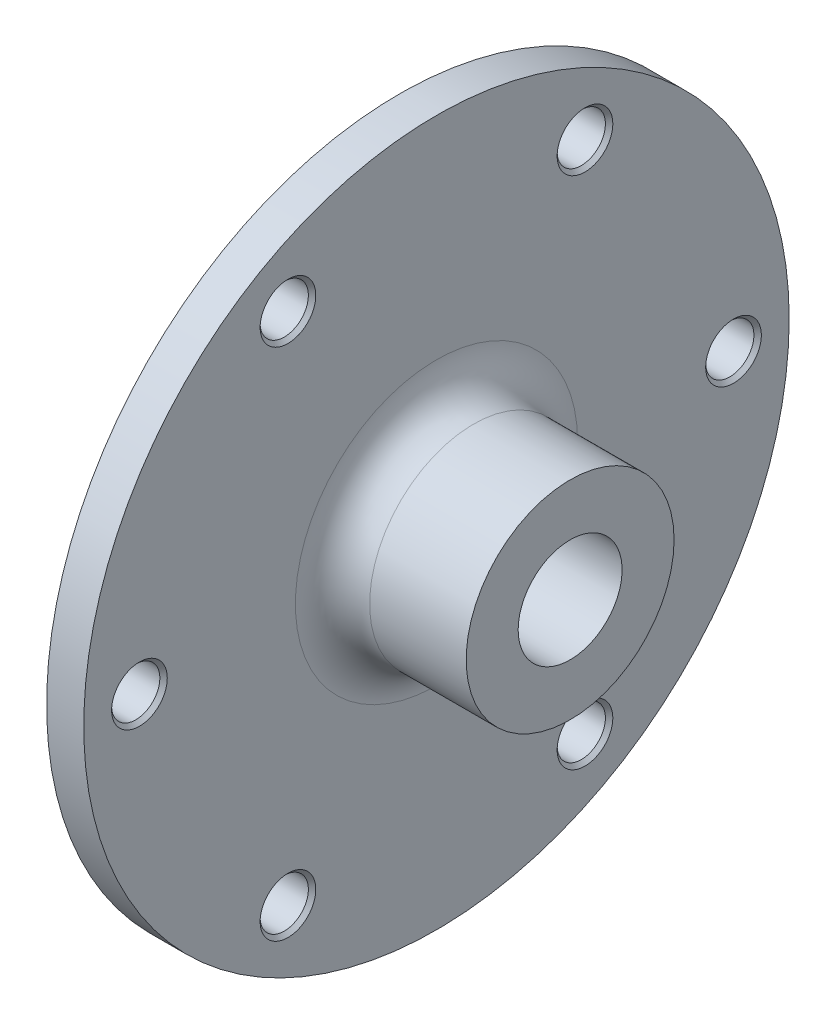
ISO-10303-21;
HEADER;
FILE_DESCRIPTION(('STEP AP214'),'2;1');
FILE_NAME('part.step','',(''),(''),'','','');
FILE_SCHEMA(('AUTOMOTIVE_DESIGN { 1 0 10303 214 1 1 1 1 }'));
ENDSEC;
DATA;
#1=APPLICATION_CONTEXT('core data for automotive mechanical design processes');
#2=APPLICATION_PROTOCOL_DEFINITION('international standard','automotive_design',2000,#1);
#3=PRODUCT_CONTEXT('',#1,'mechanical');
#4=PRODUCT('Part','Part','',(#3));
#5=PRODUCT_RELATED_PRODUCT_CATEGORY('part','',(#4));
#6=PRODUCT_DEFINITION_FORMATION('','',#4);
#7=PRODUCT_DEFINITION_CONTEXT('part definition',#1,'design');
#8=PRODUCT_DEFINITION('design','',#6,#7);
#9=PRODUCT_DEFINITION_SHAPE('','',#8);
#10=(LENGTH_UNIT() NAMED_UNIT(*) SI_UNIT(.MILLI.,.METRE.));
#11=(NAMED_UNIT(*) PLANE_ANGLE_UNIT() SI_UNIT($,.RADIAN.));
#12=(NAMED_UNIT(*) SI_UNIT($,.STERADIAN.) SOLID_ANGLE_UNIT());
#13=UNCERTAINTY_MEASURE_WITH_UNIT(LENGTH_MEASURE(1.E-05),#10,'distance_accuracy_value','');
#14=(GEOMETRIC_REPRESENTATION_CONTEXT(3) GLOBAL_UNCERTAINTY_ASSIGNED_CONTEXT((#13)) GLOBAL_UNIT_ASSIGNED_CONTEXT((#10,
#11,#12)) REPRESENTATION_CONTEXT('',''));
#15=CARTESIAN_POINT('',(0.,0.,0.));
#16=DIRECTION('',(0.,0.,1.));
#17=DIRECTION('',(1.,0.,0.));
#18=AXIS2_PLACEMENT_3D('',#15,#16,#17);
#19=CARTESIAN_POINT('',(0.,14.,0.));
#20=DIRECTION('',(1.,0.,0.));
#21=DIRECTION('',(0.,0.,-1.));
#22=AXIS2_PLACEMENT_3D('',#19,#20,#21);
#23=PLANE('',#22);
#24=CARTESIAN_POINT('',(0.,0.,0.));
#25=DIRECTION('',(-1.,0.,0.));
#26=DIRECTION('',(0.,0.,1.));
#27=AXIS2_PLACEMENT_3D('',#24,#25,#26);
#28=CIRCLE('',#27,6.99999999999999);
#29=CARTESIAN_POINT('',(0.,0.,6.99999999999999));
#30=VERTEX_POINT('',#29);
#31=EDGE_CURVE('E77',#30,#30,#28,.T.);
#32=ORIENTED_EDGE('',*,*,#31,.T.);
#33=EDGE_LOOP('',(#32));
#34=FACE_BOUND('',#33,.T.);
#35=CARTESIAN_POINT('',(0.,0.,0.));
#36=DIRECTION('',(1.,0.,0.));
#37=DIRECTION('',(0.,0.,-1.));
#38=AXIS2_PLACEMENT_3D('',#35,#36,#37);
#39=CIRCLE('',#38,14.);
#40=CARTESIAN_POINT('',(0.,0.,-14.));
#41=VERTEX_POINT('',#40);
#42=EDGE_CURVE('E73',#41,#41,#39,.T.);
#43=ORIENTED_EDGE('',*,*,#42,.T.);
#44=EDGE_LOOP('',(#43));
#45=FACE_BOUND('',#44,.T.);
#46=ADVANCED_FACE('F41',(#34,#45),#23,.T.);
#47=CARTESIAN_POINT('',(-28.,0.,0.));
#48=DIRECTION('',(-1.,0.,0.));
#49=DIRECTION('',(0.,0.,1.));
#50=AXIS2_PLACEMENT_3D('',#47,#48,#49);
#51=PLANE('',#50);
#52=CARTESIAN_POINT('',(-28.,0.,0.));
#53=DIRECTION('',(-1.,0.,0.));
#54=DIRECTION('',(0.,0.,1.));
#55=AXIS2_PLACEMENT_3D('',#52,#53,#54);
#56=CIRCLE('',#55,13.);
#57=CARTESIAN_POINT('',(-28.,0.,13.));
#58=VERTEX_POINT('',#57);
#59=EDGE_CURVE('E85',#58,#58,#56,.T.);
#60=ORIENTED_EDGE('',*,*,#59,.F.);
#61=EDGE_LOOP('',(#60));
#62=FACE_BOUND('',#61,.T.);
#63=CARTESIAN_POINT('',(-28.,0.,0.));
#64=DIRECTION('',(1.,0.,0.));
#65=DIRECTION('',(0.,0.,-1.));
#66=AXIS2_PLACEMENT_3D('',#63,#64,#65);
#67=CIRCLE('',#66,35.);
#68=CARTESIAN_POINT('',(-28.,0.,-35.));
#69=VERTEX_POINT('',#68);
#70=EDGE_CURVE('E55',#69,#69,#67,.T.);
#71=ORIENTED_EDGE('',*,*,#70,.F.);
#72=EDGE_LOOP('',(#71));
#73=FACE_BOUND('',#72,.T.);
#74=ADVANCED_FACE('F184',(#62,#73),#51,.T.);
#75=CARTESIAN_POINT('',(0.,0.,0.));
#76=DIRECTION('',(1.,0.,0.));
#77=DIRECTION('',(0.,0.,-1.));
#78=AXIS2_PLACEMENT_3D('',#75,#76,#77);
#79=CYLINDRICAL_SURFACE('',#78,35.);
#80=ORIENTED_EDGE('',*,*,#70,.T.);
#81=EDGE_LOOP('',(#80));
#82=FACE_BOUND('',#81,.T.);
#83=CARTESIAN_POINT('',(-23.,0.,0.));
#84=DIRECTION('',(1.,0.,0.));
#85=DIRECTION('',(0.,0.,-1.));
#86=AXIS2_PLACEMENT_3D('',#83,#84,#85);
#87=CIRCLE('',#86,35.);
#88=CARTESIAN_POINT('',(-23.,0.,-35.));
#89=VERTEX_POINT('',#88);
#90=EDGE_CURVE('E61',#89,#89,#87,.T.);
#91=ORIENTED_EDGE('',*,*,#90,.F.);
#92=EDGE_LOOP('',(#91));
#93=FACE_BOUND('',#92,.T.);
#94=ADVANCED_FACE('F180',(#82,#93),#79,.T.);
#95=CARTESIAN_POINT('',(-23.,35.,0.));
#96=DIRECTION('',(-1.,0.,0.));
#97=DIRECTION('',(0.,0.,1.));
#98=AXIS2_PLACEMENT_3D('',#95,#96,#97);
#99=PLANE('',#98);
#100=CARTESIAN_POINT('',(-23.,34.6410161513773,20.0000000000004));
#101=DIRECTION('',(-1.,0.,0.));
#102=DIRECTION('',(0.,0.866025403784433,0.50000000000001));
#103=AXIS2_PLACEMENT_3D('',#100,#101,#102);
#104=CIRCLE('',#103,3.25);
#105=CARTESIAN_POINT('',(-23.,37.4555987136767,21.6250000000004));
#106=VERTEX_POINT('',#105);
#107=EDGE_CURVE('E115',#106,#106,#104,.T.);
#108=ORIENTED_EDGE('',*,*,#107,.F.);
#109=EDGE_LOOP('',(#108));
#110=FACE_BOUND('',#109,.T.);
#111=CARTESIAN_POINT('',(-23.,34.6410161513777,-19.9999999999997));
#112=DIRECTION('',(-1.,0.,0.));
#113=DIRECTION('',(0.,0.866025403784443,-0.499999999999992));
#114=AXIS2_PLACEMENT_3D('',#111,#112,#113);
#115=CIRCLE('',#114,3.25);
#116=CARTESIAN_POINT('',(-23.,37.4555987136772,-21.6249999999997));
#117=VERTEX_POINT('',#116);
#118=EDGE_CURVE('E128',#117,#117,#115,.T.);
#119=ORIENTED_EDGE('',*,*,#118,.F.);
#120=EDGE_LOOP('',(#119));
#121=FACE_BOUND('',#120,.T.);
#122=CARTESIAN_POINT('',(-23.,0.,-40.));
#123=DIRECTION('',(-1.,0.,0.));
#124=DIRECTION('',(0.,0.,-1.));
#125=AXIS2_PLACEMENT_3D('',#122,#123,#124);
#126=CIRCLE('',#125,3.25);
#127=CARTESIAN_POINT('',(-23.,0.,-43.25));
#128=VERTEX_POINT('',#127);
#129=EDGE_CURVE('E140',#128,#128,#126,.T.);
#130=ORIENTED_EDGE('',*,*,#129,.F.);
#131=EDGE_LOOP('',(#130));
#132=FACE_BOUND('',#131,.T.);
#133=CARTESIAN_POINT('',(-23.,-34.6410161513775,-20.0000000000002));
#134=DIRECTION('',(-1.,0.,0.));
#135=DIRECTION('',(0.,-0.866025403784436,-0.500000000000004));
#136=AXIS2_PLACEMENT_3D('',#133,#134,#135);
#137=CIRCLE('',#136,3.25);
#138=CARTESIAN_POINT('',(-23.,-37.4555987136769,-21.6250000000002));
#139=VERTEX_POINT('',#138);
#140=EDGE_CURVE('E150',#139,#139,#137,.T.);
#141=ORIENTED_EDGE('',*,*,#140,.F.);
#142=EDGE_LOOP('',(#141));
#143=FACE_BOUND('',#142,.T.);
#144=CARTESIAN_POINT('',(-23.,-34.6410161513776,19.9999999999999));
#145=DIRECTION('',(-1.,0.,0.));
#146=DIRECTION('',(0.,-0.86602540378444,0.499999999999998));
#147=AXIS2_PLACEMENT_3D('',#144,#145,#146);
#148=CIRCLE('',#147,3.25);
#149=CARTESIAN_POINT('',(-23.,-37.455598713677,21.6249999999999));
#150=VERTEX_POINT('',#149);
#151=EDGE_CURVE('E101',#150,#150,#148,.T.);
#152=ORIENTED_EDGE('',*,*,#151,.F.);
#153=EDGE_LOOP('',(#152));
#154=FACE_BOUND('',#153,.T.);
#155=CARTESIAN_POINT('',(-23.,0.,40.));
#156=DIRECTION('',(-1.,0.,0.));
#157=DIRECTION('',(0.,0.,1.));
#158=AXIS2_PLACEMENT_3D('',#155,#156,#157);
#159=CIRCLE('',#158,3.25);
#160=CARTESIAN_POINT('',(-23.,0.,43.25));
#161=VERTEX_POINT('',#160);
#162=EDGE_CURVE('E45',#161,#161,#159,.T.);
#163=ORIENTED_EDGE('',*,*,#162,.F.);
#164=EDGE_LOOP('',(#163));
#165=FACE_BOUND('',#164,.T.);
#166=ORIENTED_EDGE('',*,*,#90,.T.);
#167=EDGE_LOOP('',(#166));
#168=FACE_BOUND('',#167,.T.);
#169=CARTESIAN_POINT('',(-23.,0.,0.));
#170=DIRECTION('',(1.,0.,0.));
#171=DIRECTION('',(0.,0.,-1.));
#172=AXIS2_PLACEMENT_3D('',#169,#170,#171);
#173=CIRCLE('',#172,47.5);
#174=CARTESIAN_POINT('',(-23.,0.,-47.5));
#175=VERTEX_POINT('',#174);
#176=EDGE_CURVE('E65',#175,#175,#173,.T.);
#177=ORIENTED_EDGE('',*,*,#176,.F.);
#178=EDGE_LOOP('',(#177));
#179=FACE_BOUND('',#178,.T.);
#180=ADVANCED_FACE('F174',(#110,#121,#132,#143,#154,#165,#168,#179),#99,.T.);
#181=CARTESIAN_POINT('',(0.,0.,0.));
#182=DIRECTION('',(1.,0.,0.));
#183=DIRECTION('',(0.,0.,-1.));
#184=AXIS2_PLACEMENT_3D('',#181,#182,#183);
#185=CYLINDRICAL_SURFACE('',#184,47.5);
#186=ORIENTED_EDGE('',*,*,#176,.T.);
#187=EDGE_LOOP('',(#186));
#188=FACE_BOUND('',#187,.T.);
#189=CARTESIAN_POINT('',(-18.,0.,0.));
#190=DIRECTION('',(1.,0.,0.));
#191=DIRECTION('',(0.,0.,-1.));
#192=AXIS2_PLACEMENT_3D('',#189,#190,#191);
#193=CIRCLE('',#192,47.5);
#194=CARTESIAN_POINT('',(-18.,0.,-47.5));
#195=VERTEX_POINT('',#194);
#196=EDGE_CURVE('E69',#195,#195,#193,.T.);
#197=ORIENTED_EDGE('',*,*,#196,.F.);
#198=EDGE_LOOP('',(#197));
#199=FACE_BOUND('',#198,.T.);
#200=ADVANCED_FACE('F164',(#188,#199),#185,.T.);
#201=CARTESIAN_POINT('',(-18.,47.5,0.));
#202=DIRECTION('',(1.,0.,0.));
#203=DIRECTION('',(0.,0.,-1.));
#204=AXIS2_PLACEMENT_3D('',#201,#202,#203);
#205=PLANE('',#204);
#206=CARTESIAN_POINT('',(-18.,34.6410161513773,20.0000000000004));
#207=DIRECTION('',(1.,0.,0.));
#208=DIRECTION('',(0.,-0.866025403784433,-0.50000000000001));
#209=AXIS2_PLACEMENT_3D('',#206,#207,#208);
#210=CIRCLE('',#209,3.75);
#211=CARTESIAN_POINT('',(-18.,31.3934208871857,18.1250000000004));
#212=VERTEX_POINT('',#211);
#213=EDGE_CURVE('E119',#212,#212,#210,.T.);
#214=ORIENTED_EDGE('',*,*,#213,.F.);
#215=EDGE_LOOP('',(#214));
#216=FACE_BOUND('',#215,.T.);
#217=CARTESIAN_POINT('',(-18.,34.6410161513777,-19.9999999999997));
#218=DIRECTION('',(1.,0.,0.));
#219=DIRECTION('',(0.,-0.866025403784443,0.499999999999992));
#220=AXIS2_PLACEMENT_3D('',#217,#218,#219);
#221=CIRCLE('',#220,3.75);
#222=CARTESIAN_POINT('',(-18.,31.3934208871861,-18.1249999999997));
#223=VERTEX_POINT('',#222);
#224=EDGE_CURVE('E114',#223,#223,#221,.T.);
#225=ORIENTED_EDGE('',*,*,#224,.F.);
#226=EDGE_LOOP('',(#225));
#227=FACE_BOUND('',#226,.T.);
#228=CARTESIAN_POINT('',(-18.,0.,-40.));
#229=DIRECTION('',(1.,0.,0.));
#230=DIRECTION('',(0.,0.,1.));
#231=AXIS2_PLACEMENT_3D('',#228,#229,#230);
#232=CIRCLE('',#231,3.75);
#233=CARTESIAN_POINT('',(-18.,0.,-36.25));
#234=VERTEX_POINT('',#233);
#235=EDGE_CURVE('E127',#234,#234,#232,.T.);
#236=ORIENTED_EDGE('',*,*,#235,.F.);
#237=EDGE_LOOP('',(#236));
#238=FACE_BOUND('',#237,.T.);
#239=CARTESIAN_POINT('',(-18.,-34.6410161513775,-20.0000000000002));
#240=DIRECTION('',(1.,0.,0.));
#241=DIRECTION('',(0.,0.866025403784436,0.500000000000004));
#242=AXIS2_PLACEMENT_3D('',#239,#240,#241);
#243=CIRCLE('',#242,3.75);
#244=CARTESIAN_POINT('',(-18.,-31.3934208871858,-18.1250000000001));
#245=VERTEX_POINT('',#244);
#246=EDGE_CURVE('E139',#245,#245,#243,.T.);
#247=ORIENTED_EDGE('',*,*,#246,.F.);
#248=EDGE_LOOP('',(#247));
#249=FACE_BOUND('',#248,.T.);
#250=CARTESIAN_POINT('',(-18.,-34.6410161513776,19.9999999999999));
#251=DIRECTION('',(1.,0.,0.));
#252=DIRECTION('',(0.,0.86602540378444,-0.499999999999998));
#253=AXIS2_PLACEMENT_3D('',#250,#251,#252);
#254=CIRCLE('',#253,3.75);
#255=CARTESIAN_POINT('',(-18.,-31.3934208871859,18.1249999999999));
#256=VERTEX_POINT('',#255);
#257=EDGE_CURVE('E105',#256,#256,#254,.T.);
#258=ORIENTED_EDGE('',*,*,#257,.F.);
#259=EDGE_LOOP('',(#258));
#260=FACE_BOUND('',#259,.T.);
#261=CARTESIAN_POINT('',(-18.,0.,40.));
#262=DIRECTION('',(1.,0.,0.));
#263=DIRECTION('',(0.,0.,-1.));
#264=AXIS2_PLACEMENT_3D('',#261,#262,#263);
#265=CIRCLE('',#264,3.75);
#266=CARTESIAN_POINT('',(-18.,0.,36.25));
#267=VERTEX_POINT('',#266);
#268=EDGE_CURVE('E93',#267,#267,#265,.T.);
#269=ORIENTED_EDGE('',*,*,#268,.F.);
#270=EDGE_LOOP('',(#269));
#271=FACE_BOUND('',#270,.T.);
#272=CARTESIAN_POINT('',(-18.,0.,0.));
#273=DIRECTION('',(1.,0.,0.));
#274=DIRECTION('',(0.,0.,-1.));
#275=AXIS2_PLACEMENT_3D('',#272,#273,#274);
#276=CIRCLE('',#275,19.);
#277=CARTESIAN_POINT('',(-18.,0.,-19.));
#278=VERTEX_POINT('',#277);
#279=EDGE_CURVE('E10',#278,#278,#276,.F.);
#280=ORIENTED_EDGE('',*,*,#279,.T.);
#281=EDGE_LOOP('',(#280));
#282=FACE_BOUND('',#281,.T.);
#283=ORIENTED_EDGE('',*,*,#196,.T.);
#284=EDGE_LOOP('',(#283));
#285=FACE_BOUND('',#284,.T.);
#286=ADVANCED_FACE('F160',(#216,#227,#238,#249,#260,#271,#282,#285),#205,.T.);
#287=CARTESIAN_POINT('',(0.,0.,0.));
#288=DIRECTION('',(1.,0.,0.));
#289=DIRECTION('',(0.,0.,-1.));
#290=AXIS2_PLACEMENT_3D('',#287,#288,#289);
#291=CYLINDRICAL_SURFACE('',#290,14.);
#292=CARTESIAN_POINT('',(-13.,0.,0.));
#293=DIRECTION('',(1.,0.,0.));
#294=DIRECTION('',(0.,0.,-1.));
#295=AXIS2_PLACEMENT_3D('',#292,#293,#294);
#296=CIRCLE('',#295,14.);
#297=CARTESIAN_POINT('',(-13.,0.,-14.));
#298=VERTEX_POINT('',#297);
#299=EDGE_CURVE('E50',#298,#298,#296,.T.);
#300=ORIENTED_EDGE('',*,*,#299,.T.);
#301=EDGE_LOOP('',(#300));
#302=FACE_BOUND('',#301,.T.);
#303=ORIENTED_EDGE('',*,*,#42,.F.);
#304=EDGE_LOOP('',(#303));
#305=FACE_BOUND('',#304,.T.);
#306=ADVANCED_FACE('F163',(#302,#305),#291,.T.);
#307=CARTESIAN_POINT('',(-13.,0.,0.));
#308=DIRECTION('',(1.,0.,0.));
#309=DIRECTION('',(0.,0.,-1.));
#310=AXIS2_PLACEMENT_3D('',#307,#308,#309);
#311=TOROIDAL_SURFACE('',#310,19.,5.);
#312=ORIENTED_EDGE('',*,*,#279,.F.);
#313=EDGE_LOOP('',(#312));
#314=FACE_BOUND('',#313,.T.);
#315=ORIENTED_EDGE('',*,*,#299,.F.);
#316=EDGE_LOOP('',(#315));
#317=FACE_BOUND('',#316,.T.);
#318=ADVANCED_FACE('F43',(#314,#317),#311,.F.);
#319=CARTESIAN_POINT('',(-28.,0.,0.));
#320=DIRECTION('',(-1.,0.,0.));
#321=DIRECTION('',(0.,0.,1.));
#322=AXIS2_PLACEMENT_3D('',#319,#320,#321);
#323=CYLINDRICAL_SURFACE('',#322,7.);
#324=ORIENTED_EDGE('',*,*,#31,.F.);
#325=EDGE_LOOP('',(#324));
#326=FACE_BOUND('',#325,.T.);
#327=CARTESIAN_POINT('',(-22.,0.,0.));
#328=DIRECTION('',(-1.,0.,0.));
#329=DIRECTION('',(0.,0.,1.));
#330=AXIS2_PLACEMENT_3D('',#327,#328,#329);
#331=CIRCLE('',#330,7.);
#332=CARTESIAN_POINT('',(-22.,0.,7.));
#333=VERTEX_POINT('',#332);
#334=EDGE_CURVE('E81',#333,#333,#331,.T.);
#335=ORIENTED_EDGE('',*,*,#334,.T.);
#336=EDGE_LOOP('',(#335));
#337=FACE_BOUND('',#336,.T.);
#338=ADVANCED_FACE('F371',(#326,#337),#323,.F.);
#339=CARTESIAN_POINT('',(-28.,0.,0.));
#340=DIRECTION('',(-1.,0.,0.));
#341=DIRECTION('',(0.,0.,1.));
#342=AXIS2_PLACEMENT_3D('',#339,#340,#341);
#343=CONICAL_SURFACE('',#342,13.,0.785398163397449);
#344=ORIENTED_EDGE('',*,*,#334,.F.);
#345=EDGE_LOOP('',(#344));
#346=FACE_BOUND('',#345,.T.);
#347=ORIENTED_EDGE('',*,*,#59,.T.);
#348=EDGE_LOOP('',(#347));
#349=FACE_BOUND('',#348,.T.);
#350=ADVANCED_FACE('F362',(#346,#349),#343,.F.);
#351=CARTESIAN_POINT('',(-18.,0.,40.));
#352=DIRECTION('',(1.,0.,0.));
#353=DIRECTION('',(0.,0.,-1.));
#354=AXIS2_PLACEMENT_3D('',#351,#352,#353);
#355=CYLINDRICAL_SURFACE('',#354,3.25);
#356=ORIENTED_EDGE('',*,*,#162,.T.);
#357=EDGE_LOOP('',(#356));
#358=FACE_BOUND('',#357,.T.);
#359=CARTESIAN_POINT('',(-18.5,0.,40.));
#360=DIRECTION('',(1.,0.,0.));
#361=DIRECTION('',(0.,0.,-1.));
#362=AXIS2_PLACEMENT_3D('',#359,#360,#361);
#363=CIRCLE('',#362,3.25);
#364=CARTESIAN_POINT('',(-18.5,0.,36.75));
#365=VERTEX_POINT('',#364);
#366=EDGE_CURVE('E89',#365,#365,#363,.T.);
#367=ORIENTED_EDGE('',*,*,#366,.T.);
#368=EDGE_LOOP('',(#367));
#369=FACE_BOUND('',#368,.T.);
#370=ADVANCED_FACE('F353',(#358,#369),#355,.F.);
#371=CARTESIAN_POINT('',(-18.,0.,40.));
#372=DIRECTION('',(1.,0.,0.));
#373=DIRECTION('',(0.,0.,-1.));
#374=AXIS2_PLACEMENT_3D('',#371,#372,#373);
#375=CONICAL_SURFACE('',#374,3.75,0.785398163397449);
#376=ORIENTED_EDGE('',*,*,#366,.F.);
#377=EDGE_LOOP('',(#376));
#378=FACE_BOUND('',#377,.T.);
#379=ORIENTED_EDGE('',*,*,#268,.T.);
#380=EDGE_LOOP('',(#379));
#381=FACE_BOUND('',#380,.T.);
#382=ADVANCED_FACE('F218',(#378,#381),#375,.F.);
#383=CARTESIAN_POINT('',(-18.,-34.6410161513776,19.9999999999999));
#384=DIRECTION('',(1.,0.,0.));
#385=DIRECTION('',(0.,0.86602540378444,-0.499999999999998));
#386=AXIS2_PLACEMENT_3D('',#383,#384,#385);
#387=CYLINDRICAL_SURFACE('',#386,3.25);
#388=ORIENTED_EDGE('',*,*,#151,.T.);
#389=EDGE_LOOP('',(#388));
#390=FACE_BOUND('',#389,.T.);
#391=CARTESIAN_POINT('',(-18.5,-34.6410161513776,19.9999999999999));
#392=DIRECTION('',(1.,0.,0.));
#393=DIRECTION('',(0.,0.86602540378444,-0.499999999999998));
#394=AXIS2_PLACEMENT_3D('',#391,#392,#393);
#395=CIRCLE('',#394,3.25);
#396=CARTESIAN_POINT('',(-18.5,-31.8264335890782,18.3749999999999));
#397=VERTEX_POINT('',#396);
#398=EDGE_CURVE('E97',#397,#397,#395,.T.);
#399=ORIENTED_EDGE('',*,*,#398,.T.);
#400=EDGE_LOOP('',(#399));
#401=FACE_BOUND('',#400,.T.);
#402=ADVANCED_FACE('F232',(#390,#401),#387,.F.);
#403=CARTESIAN_POINT('',(-18.,-34.6410161513776,19.9999999999999));
#404=DIRECTION('',(1.,0.,0.));
#405=DIRECTION('',(0.,0.86602540378444,-0.499999999999998));
#406=AXIS2_PLACEMENT_3D('',#403,#404,#405);
#407=CONICAL_SURFACE('',#406,3.75,0.785398163397449);
#408=ORIENTED_EDGE('',*,*,#398,.F.);
#409=EDGE_LOOP('',(#408));
#410=FACE_BOUND('',#409,.T.);
#411=ORIENTED_EDGE('',*,*,#257,.T.);
#412=EDGE_LOOP('',(#411));
#413=FACE_BOUND('',#412,.T.);
#414=ADVANCED_FACE('F237',(#410,#413),#407,.F.);
#415=CARTESIAN_POINT('',(-18.,-34.6410161513775,-20.0000000000002));
#416=DIRECTION('',(1.,0.,0.));
#417=DIRECTION('',(0.,0.866025403784436,0.500000000000004));
#418=AXIS2_PLACEMENT_3D('',#415,#416,#417);
#419=CYLINDRICAL_SURFACE('',#418,3.25);
#420=ORIENTED_EDGE('',*,*,#140,.T.);
#421=EDGE_LOOP('',(#420));
#422=FACE_BOUND('',#421,.T.);
#423=CARTESIAN_POINT('',(-18.5,-34.6410161513775,-20.0000000000002));
#424=DIRECTION('',(1.,0.,0.));
#425=DIRECTION('',(0.,0.866025403784436,0.500000000000004));
#426=AXIS2_PLACEMENT_3D('',#423,#424,#425);
#427=CIRCLE('',#426,3.25);
#428=CARTESIAN_POINT('',(-18.5,-31.826433589078,-18.3750000000002));
#429=VERTEX_POINT('',#428);
#430=EDGE_CURVE('E109',#429,#429,#427,.T.);
#431=ORIENTED_EDGE('',*,*,#430,.T.);
#432=EDGE_LOOP('',(#431));
#433=FACE_BOUND('',#432,.T.);
#434=ADVANCED_FACE('F248',(#422,#433),#419,.F.);
#435=CARTESIAN_POINT('',(-18.,-34.6410161513775,-20.0000000000002));
#436=DIRECTION('',(1.,0.,0.));
#437=DIRECTION('',(0.,0.866025403784436,0.500000000000004));
#438=AXIS2_PLACEMENT_3D('',#435,#436,#437);
#439=CONICAL_SURFACE('',#438,3.75,0.785398163397449);
#440=ORIENTED_EDGE('',*,*,#430,.F.);
#441=EDGE_LOOP('',(#440));
#442=FACE_BOUND('',#441,.T.);
#443=ORIENTED_EDGE('',*,*,#246,.T.);
#444=EDGE_LOOP('',(#443));
#445=FACE_BOUND('',#444,.T.);
#446=ADVANCED_FACE('F158',(#442,#445),#439,.F.);
#447=CARTESIAN_POINT('',(-18.,0.,-40.));
#448=DIRECTION('',(1.,0.,0.));
#449=DIRECTION('',(0.,0.,1.));
#450=AXIS2_PLACEMENT_3D('',#447,#448,#449);
#451=CYLINDRICAL_SURFACE('',#450,3.25);
#452=ORIENTED_EDGE('',*,*,#129,.T.);
#453=EDGE_LOOP('',(#452));
#454=FACE_BOUND('',#453,.T.);
#455=CARTESIAN_POINT('',(-18.5,0.,-40.));
#456=DIRECTION('',(1.,0.,0.));
#457=DIRECTION('',(0.,0.,1.));
#458=AXIS2_PLACEMENT_3D('',#455,#456,#457);
#459=CIRCLE('',#458,3.25);
#460=CARTESIAN_POINT('',(-18.5,0.,-36.75));
#461=VERTEX_POINT('',#460);
#462=EDGE_CURVE('E135',#461,#461,#459,.T.);
#463=ORIENTED_EDGE('',*,*,#462,.T.);
#464=EDGE_LOOP('',(#463));
#465=FACE_BOUND('',#464,.T.);
#466=ADVANCED_FACE('F269',(#454,#465),#451,.F.);
#467=CARTESIAN_POINT('',(-18.,0.,-40.));
#468=DIRECTION('',(1.,0.,0.));
#469=DIRECTION('',(0.,0.,1.));
#470=AXIS2_PLACEMENT_3D('',#467,#468,#469);
#471=CONICAL_SURFACE('',#470,3.75,0.785398163397449);
#472=ORIENTED_EDGE('',*,*,#462,.F.);
#473=EDGE_LOOP('',(#472));
#474=FACE_BOUND('',#473,.T.);
#475=ORIENTED_EDGE('',*,*,#235,.T.);
#476=EDGE_LOOP('',(#475));
#477=FACE_BOUND('',#476,.T.);
#478=ADVANCED_FACE('F280',(#474,#477),#471,.F.);
#479=CARTESIAN_POINT('',(-18.,34.6410161513777,-19.9999999999997));
#480=DIRECTION('',(1.,0.,0.));
#481=DIRECTION('',(0.,-0.866025403784443,0.499999999999992));
#482=AXIS2_PLACEMENT_3D('',#479,#480,#481);
#483=CYLINDRICAL_SURFACE('',#482,3.25);
#484=ORIENTED_EDGE('',*,*,#118,.T.);
#485=EDGE_LOOP('',(#484));
#486=FACE_BOUND('',#485,.T.);
#487=CARTESIAN_POINT('',(-18.5,34.6410161513777,-19.9999999999997));
#488=DIRECTION('',(1.,0.,0.));
#489=DIRECTION('',(0.,-0.866025403784443,0.499999999999992));
#490=AXIS2_PLACEMENT_3D('',#487,#488,#489);
#491=CIRCLE('',#490,3.25);
#492=CARTESIAN_POINT('',(-18.5,31.8264335890783,-18.3749999999997));
#493=VERTEX_POINT('',#492);
#494=EDGE_CURVE('E123',#493,#493,#491,.T.);
#495=ORIENTED_EDGE('',*,*,#494,.T.);
#496=EDGE_LOOP('',(#495));
#497=FACE_BOUND('',#496,.T.);
#498=ADVANCED_FACE('F291',(#486,#497),#483,.F.);
#499=CARTESIAN_POINT('',(-18.,34.6410161513777,-19.9999999999997));
#500=DIRECTION('',(1.,0.,0.));
#501=DIRECTION('',(0.,-0.866025403784443,0.499999999999992));
#502=AXIS2_PLACEMENT_3D('',#499,#500,#501);
#503=CONICAL_SURFACE('',#502,3.75,0.785398163397449);
#504=ORIENTED_EDGE('',*,*,#494,.F.);
#505=EDGE_LOOP('',(#504));
#506=FACE_BOUND('',#505,.T.);
#507=ORIENTED_EDGE('',*,*,#224,.T.);
#508=EDGE_LOOP('',(#507));
#509=FACE_BOUND('',#508,.T.);
#510=ADVANCED_FACE('F302',(#506,#509),#503,.F.);
#511=CARTESIAN_POINT('',(-18.,34.6410161513773,20.0000000000004));
#512=DIRECTION('',(1.,0.,0.));
#513=DIRECTION('',(0.,-0.866025403784433,-0.50000000000001));
#514=AXIS2_PLACEMENT_3D('',#511,#512,#513);
#515=CYLINDRICAL_SURFACE('',#514,3.25);
#516=ORIENTED_EDGE('',*,*,#107,.T.);
#517=EDGE_LOOP('',(#516));
#518=FACE_BOUND('',#517,.T.);
#519=CARTESIAN_POINT('',(-18.5,34.6410161513773,20.0000000000004));
#520=DIRECTION('',(1.,0.,0.));
#521=DIRECTION('',(0.,-0.866025403784433,-0.50000000000001));
#522=AXIS2_PLACEMENT_3D('',#519,#520,#521);
#523=CIRCLE('',#522,3.25);
#524=CARTESIAN_POINT('',(-18.5,31.8264335890779,18.3750000000004));
#525=VERTEX_POINT('',#524);
#526=EDGE_CURVE('E110',#525,#525,#523,.T.);
#527=ORIENTED_EDGE('',*,*,#526,.T.);
#528=EDGE_LOOP('',(#527));
#529=FACE_BOUND('',#528,.T.);
#530=ADVANCED_FACE('F313',(#518,#529),#515,.F.);
#531=CARTESIAN_POINT('',(-18.,34.6410161513773,20.0000000000004));
#532=DIRECTION('',(1.,0.,0.));
#533=DIRECTION('',(0.,-0.866025403784433,-0.50000000000001));
#534=AXIS2_PLACEMENT_3D('',#531,#532,#533);
#535=CONICAL_SURFACE('',#534,3.75,0.785398163397449);
#536=ORIENTED_EDGE('',*,*,#526,.F.);
#537=EDGE_LOOP('',(#536));
#538=FACE_BOUND('',#537,.T.);
#539=ORIENTED_EDGE('',*,*,#213,.T.);
#540=EDGE_LOOP('',(#539));
#541=FACE_BOUND('',#540,.T.);
#542=ADVANCED_FACE('F324',(#538,#541),#535,.F.);
#543=CLOSED_SHELL('',(#46,#74,#94,#180,#200,#286,#306,#318,#338,#350,#370,#382,#402,#414,#434,
#446,#466,#478,#498,#510,#530,#542));
#544=MANIFOLD_SOLID_BREP('B2',#543);
#545=ADVANCED_BREP_SHAPE_REPRESENTATION('',(#18,#544),#14);
#546=SHAPE_DEFINITION_REPRESENTATION(#9,#545);
ENDSEC;
END-ISO-10303-21;
